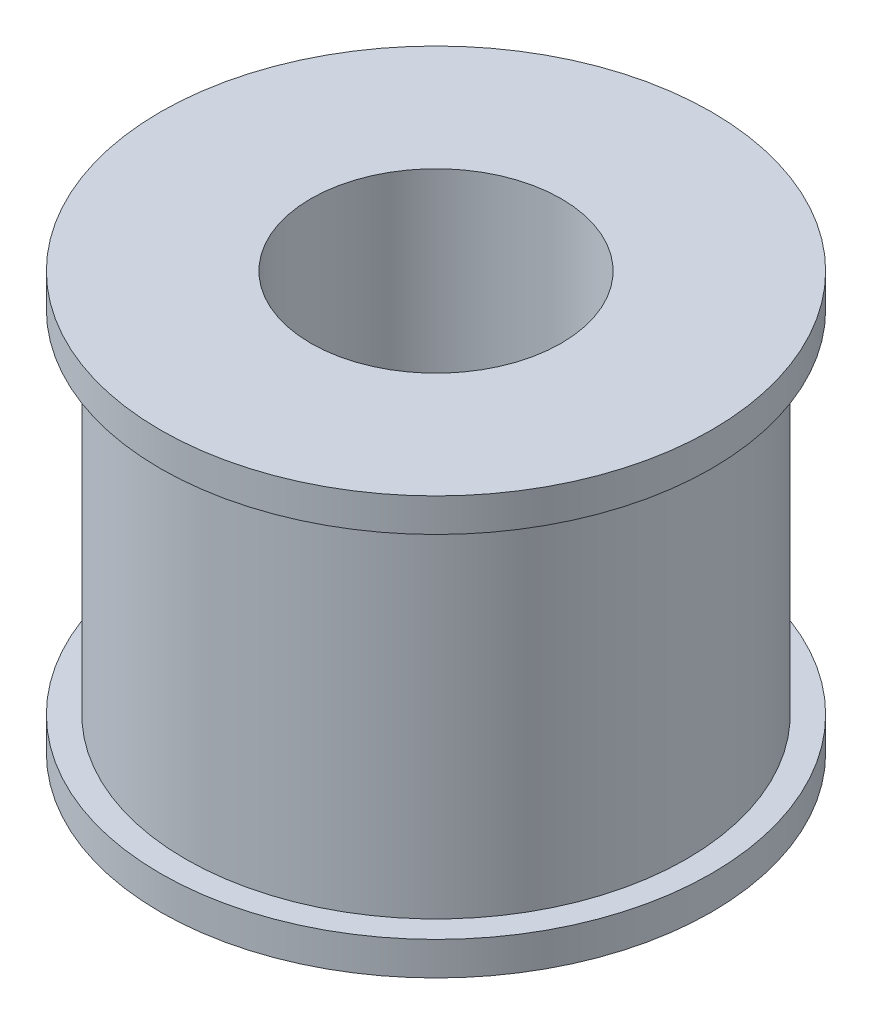
ISO-10303-21;
HEADER;
FILE_DESCRIPTION(('STEP AP214'),'2;1');
FILE_NAME('part.step','',(''),(''),'','','');
FILE_SCHEMA(('AUTOMOTIVE_DESIGN { 1 0 10303 214 1 1 1 1 }'));
ENDSEC;
DATA;
#1=APPLICATION_CONTEXT('core data for automotive mechanical design processes');
#2=APPLICATION_PROTOCOL_DEFINITION('international standard','automotive_design',2000,#1);
#3=PRODUCT_CONTEXT('',#1,'mechanical');
#4=PRODUCT('Part','Part','',(#3));
#5=PRODUCT_RELATED_PRODUCT_CATEGORY('part','',(#4));
#6=PRODUCT_DEFINITION_FORMATION('','',#4);
#7=PRODUCT_DEFINITION_CONTEXT('part definition',#1,'design');
#8=PRODUCT_DEFINITION('design','',#6,#7);
#9=PRODUCT_DEFINITION_SHAPE('','',#8);
#10=(LENGTH_UNIT() NAMED_UNIT(*) SI_UNIT(.MILLI.,.METRE.));
#11=(NAMED_UNIT(*) PLANE_ANGLE_UNIT() SI_UNIT($,.RADIAN.));
#12=(NAMED_UNIT(*) SI_UNIT($,.STERADIAN.) SOLID_ANGLE_UNIT());
#13=UNCERTAINTY_MEASURE_WITH_UNIT(LENGTH_MEASURE(1.E-05),#10,'distance_accuracy_value','');
#14=(GEOMETRIC_REPRESENTATION_CONTEXT(3) GLOBAL_UNCERTAINTY_ASSIGNED_CONTEXT((#13)) GLOBAL_UNIT_ASSIGNED_CONTEXT((#10,
#11,#12)) REPRESENTATION_CONTEXT('',''));
#15=CARTESIAN_POINT('',(0.,0.,0.));
#16=DIRECTION('',(0.,0.,1.));
#17=DIRECTION('',(1.,0.,0.));
#18=AXIS2_PLACEMENT_3D('',#15,#16,#17);
#19=CARTESIAN_POINT('',(0.,25.,0.));
#20=DIRECTION('',(0.,-1.,0.));
#21=DIRECTION('',(0.,0.,-1.));
#22=AXIS2_PLACEMENT_3D('',#19,#20,#21);
#23=CYLINDRICAL_SURFACE('',#22,3.);
#24=CARTESIAN_POINT('',(0.,0.,0.));
#25=DIRECTION('',(0.,1.,0.));
#26=DIRECTION('',(0.,0.,1.));
#27=AXIS2_PLACEMENT_3D('',#24,#25,#26);
#28=CIRCLE('',#27,3.);
#29=CARTESIAN_POINT('',(0.,0.,3.));
#30=VERTEX_POINT('',#29);
#31=EDGE_CURVE('E45',#30,#30,#28,.T.);
#32=ORIENTED_EDGE('',*,*,#31,.F.);
#33=EDGE_LOOP('',(#32));
#34=FACE_BOUND('',#33,.T.);
#35=CARTESIAN_POINT('',(1.625,5.,-2.521780125229));
#36=CARTESIAN_POINT('',(1.62499362610396,4.91647567107102,-2.52178884654117));
#37=CARTESIAN_POINT('',(1.61851585641467,4.83287244644267,-2.52599501945757));
#38=CARTESIAN_POINT('',(1.59297861462206,4.6683256364093,-2.54217064533891));
#39=CARTESIAN_POINT('',(1.57389710574364,4.58738697049031,-2.55415369499862));
#40=CARTESIAN_POINT('',(1.52427817740289,4.43087471587903,-2.58406681920894));
#41=CARTESIAN_POINT('',(1.49381028464491,4.35527181130049,-2.60196072584982));
#42=CARTESIAN_POINT('',(1.42249724665063,4.21027693964684,-2.64162110161326));
#43=CARTESIAN_POINT('',(1.38165016988108,4.14088613187722,-2.66338829131529));
#44=CARTESIAN_POINT('',(1.28606573612756,4.00281297757973,-2.71093173114226));
#45=CARTESIAN_POINT('',(1.23036059831293,3.93486364791188,-2.7368918673873));
#46=CARTESIAN_POINT('',(1.10864243894811,3.8086867522882,-2.78841941781855));
#47=CARTESIAN_POINT('',(1.04262348172815,3.75046482469484,-2.81398659649028));
#48=CARTESIAN_POINT('',(0.89551160217396,3.64066872614016,-2.86436429896294));
#49=CARTESIAN_POINT('',(0.813624236880456,3.59003997769905,-2.88893816491266));
#50=CARTESIAN_POINT('',(0.640911470519763,3.5036176638638,-2.9320863076302));
#51=CARTESIAN_POINT('',(0.550092737901573,3.46781313274385,-2.95066501686498));
#52=CARTESIAN_POINT('',(0.369897501143644,3.41510793344741,-2.97838863309815));
#53=CARTESIAN_POINT('',(0.281002067442789,3.39690896510625,-2.98817676403926));
#54=CARTESIAN_POINT('',(0.100927404427291,3.37561060880875,-2.99965505637116));
#55=CARTESIAN_POINT('',(0.00974989246369477,3.37250019032237,-3.00135113346747));
#56=CARTESIAN_POINT('',(-0.162347576331279,3.38107155998096,-2.99671477897577));
#57=CARTESIAN_POINT('',(-0.243368142517105,3.39128192920775,-2.99118088232813));
#58=CARTESIAN_POINT('',(-0.402336701214962,3.42350767664372,-2.97397337010464));
#59=CARTESIAN_POINT('',(-0.480284458564604,3.44552395648496,-2.96229928559631));
#60=CARTESIAN_POINT('',(-0.63207455464856,3.50076381349264,-2.93368734546312));
#61=CARTESIAN_POINT('',(-0.705859929075177,3.53411235165183,-2.91669097245024));
#62=CARTESIAN_POINT('',(-0.846938184886932,3.61083633152674,-2.87889510857995));
#63=CARTESIAN_POINT('',(-0.91422892621452,3.65421506242804,-2.85809437063173));
#64=CARTESIAN_POINT('',(-1.04801466719267,3.75499915650264,-2.8119717864549));
#65=CARTESIAN_POINT('',(-1.11367327603698,3.81340264002554,-2.78640445121692));
#66=CARTESIAN_POINT('',(-1.23475234459078,3.93995606194131,-2.73490853839924));
#67=CARTESIAN_POINT('',(-1.2901626002163,4.00811559576566,-2.7089796281294));
#68=CARTESIAN_POINT('',(-1.39377486129465,4.15911791911366,-2.65725751747602));
#69=CARTESIAN_POINT('',(-1.44098913960444,4.24271143567745,-2.63165629719171));
#70=CARTESIAN_POINT('',(-1.5203587042321,4.41828931014661,-2.58662109254775));
#71=CARTESIAN_POINT('',(-1.55253127212028,4.51026389300709,-2.56718003903186));
#72=CARTESIAN_POINT('',(-1.59812522493745,4.69228534022437,-2.53902859798761));
#73=CARTESIAN_POINT('',(-1.61285549939508,4.78188382300329,-2.52957594769987));
#74=CARTESIAN_POINT('',(-1.62709553982775,4.96273938431094,-2.52044556051586));
#75=CARTESIAN_POINT('',(-1.6266213251134,5.05399461596327,-2.52075753569134));
#76=CARTESIAN_POINT('',(-1.6116650884512,5.22196402891728,-2.53033241096107));
#77=CARTESIAN_POINT('',(-1.59913775035001,5.2989374702016,-2.53834610426687));
#78=CARTESIAN_POINT('',(-1.56351314461445,5.44948708742494,-2.56044192007669));
#79=CARTESIAN_POINT('',(-1.54041149876914,5.52306184225863,-2.57452655606692));
#80=CARTESIAN_POINT('',(-1.48330763694687,5.66842211919627,-2.60785937209035));
#81=CARTESIAN_POINT('',(-1.44887654692676,5.73999204648474,-2.62730481169378));
#82=CARTESIAN_POINT('',(-1.37044806619068,5.87676666541915,-2.66905325078274));
#83=CARTESIAN_POINT('',(-1.32644586554113,5.94196813265417,-2.69135768472439));
#84=CARTESIAN_POINT('',(-1.22230316396257,6.07459354253663,-2.74039556583206));
#85=CARTESIAN_POINT('',(-1.16072421643766,6.14083561603439,-2.76728512045753));
#86=CARTESIAN_POINT('',(-1.02707583252912,6.26250184432116,-2.81962198065225));
#87=CARTESIAN_POINT('',(-0.955000762805303,6.31792015229087,-2.84506850148092));
#88=CARTESIAN_POINT('',(-0.798115671580059,6.41870176479678,-2.89310153929838));
#89=CARTESIAN_POINT('',(-0.712872708944511,6.46348615652539,-2.91550295414492));
#90=CARTESIAN_POINT('',(-0.534505621432121,6.53760486976178,-2.9534021705525));
#91=CARTESIAN_POINT('',(-0.44138960806974,6.56695487331969,-2.96890697690612));
#92=CARTESIAN_POINT('',(-0.259992391421341,6.60647524542024,-2.98996496264615));
#93=CARTESIAN_POINT('',(-0.172164501552213,6.61827549628704,-2.99636104576615));
#94=CARTESIAN_POINT('',(0.00444487101537017,6.62739394717314,-3.00129434113477));
#95=CARTESIAN_POINT('',(0.093225862830992,6.62471927583816,-2.99983542183636));
#96=CARTESIAN_POINT('',(0.261188522805945,6.60590681183214,-2.98969237921464));
#97=CARTESIAN_POINT('',(0.340543637188175,6.59093537023404,-2.98163436789865));
#98=CARTESIAN_POINT('',(0.495432823547957,6.54970841054607,-2.95984216222459));
#99=CARTESIAN_POINT('',(0.570966424731545,6.52345150590093,-2.94610727040123));
#100=CARTESIAN_POINT('',(0.719186038389683,6.45950257807398,-2.91354409902028));
#101=CARTESIAN_POINT('',(0.791671383281743,6.42143261692066,-2.89455012777675));
#102=CARTESIAN_POINT('',(0.929476456393731,6.3354043604806,-2.8532886071291));
#103=CARTESIAN_POINT('',(0.99479316752873,6.287441925984,-2.83101968854409));
#104=CARTESIAN_POINT('',(1.12421459926918,6.17677982546555,-2.78234471532874));
#105=CARTESIAN_POINT('',(1.18735256260398,6.11302832046199,-2.75575528045836));
#106=CARTESIAN_POINT('',(1.30249662530647,5.97578738089303,-2.7032419755199));
#107=CARTESIAN_POINT('',(1.35448979132518,5.9022867910228,-2.67731890912275));
#108=CARTESIAN_POINT('',(1.44880285545911,5.74212188572276,-2.62754301941557));
#109=CARTESIAN_POINT('',(1.49035401575236,5.65493203097275,-2.60390811353569));
#110=CARTESIAN_POINT('',(1.55758520350058,5.47314904038028,-2.56427012470215));
#111=CARTESIAN_POINT('',(1.58331656006501,5.37858098159521,-2.54824239842196));
#112=CARTESIAN_POINT('',(1.60851613266538,5.2356472359366,-2.53234221331271));
#113=CARTESIAN_POINT('',(1.61468341643518,5.18882820241346,-2.52840291933054));
#114=CARTESIAN_POINT('',(1.62292718367799,5.0946812366103,-2.52311938607778));
#115=CARTESIAN_POINT('',(1.62500361361774,5.04735329767885,-2.52177518076675));
#116=CARTESIAN_POINT('',(1.625,5.,-2.521780125229));
#117=B_SPLINE_CURVE_WITH_KNOTS('',3,(#35,#36,#37,#38,#39,#40,#41,#42,#43,#44,#45,#46,#47,#48,
#49,#50,#51,#52,#53,#54,#55,#56,#57,#58,#59,#60,#61,#62,#63,#64,#65,#66,#67,#68,#69,#70,#71,#72,
#73,#74,#75,#76,#77,#78,#79,#80,#81,#82,#83,#84,#85,#86,#87,#88,#89,#90,#91,#92,#93,#94,#95,#96,
#97,#98,#99,#100,#101,#102,#103,#104,#105,#106,#107,#108,#109,#110,#111,#112,#113,#114,#115,
#116),.UNSPECIFIED.,.T.,.F.,(4,2,2,2,2,2,2,2,2,2,2,2,2,2,2,2,2,2,2,2,2,2,2,2,2,2,2,2,2,2,2,2,2,
2,2,2,2,2,2,2,4),(0.,0.250372371078242,0.501183664001882,0.750487850304348,0.999838465347706,
1.27357587393855,1.54747140449562,1.84397527167813,2.14025941634808,2.41249928639615,
2.68454010463896,2.92892931461192,3.17333719155109,3.42053266619159,3.66780931851591,
3.94123094413897,4.21492336171583,4.51146085049713,4.80765680207996,5.079836201185,
5.35172884399928,5.58585847738579,5.82008513815954,6.06445887718592,6.30895571043233,
6.59079991795693,6.87279595452077,7.16774738273199,7.46239854482431,7.72746451911719,
7.99239996494183,8.23476524078876,8.47716030264913,8.72828927356825,8.97952353584611,
9.25908071892252,9.53896058773721,9.83565375839589,10.1313791234398,10.2733234218883,
10.4152695778198),.UNSPECIFIED.);
#118=CARTESIAN_POINT('',(1.625,5.,-2.521780125229));
#119=VERTEX_POINT('',#118);
#120=EDGE_CURVE('E69',#119,#119,#117,.T.);
#121=ORIENTED_EDGE('',*,*,#120,.T.);
#122=EDGE_LOOP('',(#121));
#123=FACE_BOUND('',#122,.T.);
#124=CARTESIAN_POINT('',(0.,9.,0.));
#125=DIRECTION('',(0.,1.,0.));
#126=DIRECTION('',(0.,0.,1.));
#127=AXIS2_PLACEMENT_3D('',#124,#125,#126);
#128=CIRCLE('',#127,3.);
#129=CARTESIAN_POINT('',(0.,9.,3.));
#130=VERTEX_POINT('',#129);
#131=EDGE_CURVE('E36',#130,#130,#128,.T.);
#132=ORIENTED_EDGE('',*,*,#131,.T.);
#133=EDGE_LOOP('',(#132));
#134=FACE_BOUND('',#133,.T.);
#135=ADVANCED_FACE('F32',(#34,#123,#134),#23,.F.);
#136=CARTESIAN_POINT('',(0.,25.,0.));
#137=DIRECTION('',(0.,-1.,0.));
#138=DIRECTION('',(0.,0.,-1.));
#139=AXIS2_PLACEMENT_3D('',#136,#137,#138);
#140=CYLINDRICAL_SURFACE('',#139,15.);
#141=CARTESIAN_POINT('',(1.625,5.,-14.9117193844305));
#142=CARTESIAN_POINT('',(1.62499607951809,4.9090108416416,-14.9117205336342));
#143=CARTESIAN_POINT('',(1.61733206770543,4.81796253610688,-14.9125611691408));
#144=CARTESIAN_POINT('',(1.58687625220947,4.63839321362523,-14.915832168487));
#145=CARTESIAN_POINT('',(1.56406804372355,4.54987504600155,-14.9182642562102));
#146=CARTESIAN_POINT('',(1.50399836576417,4.37799225972297,-14.9244395173036));
#147=CARTESIAN_POINT('',(1.46674598159897,4.29462443966606,-14.9281818663832));
#148=CARTESIAN_POINT('',(1.37886351672704,4.13534161716927,-14.9365549747082));
#149=CARTESIAN_POINT('',(1.32823597825778,4.05942520218556,-14.9411855650784));
#150=CARTESIAN_POINT('',(1.21480991566068,3.91686096045494,-14.9508354029994));
#151=CARTESIAN_POINT('',(1.15196613450361,3.85024923206282,-14.9558560527334));
#152=CARTESIAN_POINT('',(1.01598848819612,3.7284963918019,-14.9657076223121));
#153=CARTESIAN_POINT('',(0.942854140085716,3.67335581860202,-14.9705385332384));
#154=CARTESIAN_POINT('',(0.788148146230986,3.5759840546106,-14.979480349489));
#155=CARTESIAN_POINT('',(0.706556115495929,3.53378507179415,-14.9835894477508));
#156=CARTESIAN_POINT('',(0.537392028738915,3.46370047953315,-14.9906093408174));
#157=CARTESIAN_POINT('',(0.449820142002624,3.43581446508836,-14.993520169528));
#158=CARTESIAN_POINT('',(0.271548635235109,3.39525397713153,-14.9978056971795));
#159=CARTESIAN_POINT('',(0.180862714678987,3.38251993717447,-14.9991864099331));
#160=CARTESIAN_POINT('',(-0.00136887809288493,3.37244046943757,-15.0002766179743));
#161=CARTESIAN_POINT('',(-0.0929145243656087,3.37509457878616,-14.99998616353));
#162=CARTESIAN_POINT('',(-0.273862279448701,3.39566790771732,-14.9977716675837));
#163=CARTESIAN_POINT('',(-0.36327176672863,3.41352307287695,-14.9958544809421));
#164=CARTESIAN_POINT('',(-0.537817561741082,3.46389177662204,-14.9906097658352));
#165=CARTESIAN_POINT('',(-0.622953805784831,3.49640553360832,-14.9872822163566));
#166=CARTESIAN_POINT('',(-0.786737204499769,3.57523805176723,-14.979579002581));
#167=CARTESIAN_POINT('',(-0.865370704832735,3.62158496440318,-14.9752012045523));
#168=CARTESIAN_POINT('',(-1.0137675205992,3.72674772430712,-14.9658882801973));
#169=CARTESIAN_POINT('',(-1.08353053033313,3.78556400111476,-14.9609531346744));
#170=CARTESIAN_POINT('',(-1.21258158390715,3.9143557017455,-14.9510489609166));
#171=CARTESIAN_POINT('',(-1.27181399609965,3.9843868798984,-14.9460798888296));
#172=CARTESIAN_POINT('',(-1.37769125065725,4.13342770218761,-14.9366931075787));
#173=CARTESIAN_POINT('',(-1.42433606915497,4.21243736334765,-14.9322753994602));
#174=CARTESIAN_POINT('',(-1.50371485192156,4.37723721180423,-14.9244913010396));
#175=CARTESIAN_POINT('',(-1.53644506541173,4.46302921994805,-14.9211251942686));
#176=CARTESIAN_POINT('',(-1.58701989180505,4.6389358914823,-14.9158311966687));
#177=CARTESIAN_POINT('',(-1.60486503894023,4.72905039961339,-14.9139032542237));
#178=CARTESIAN_POINT('',(-1.62509096228955,4.91055475629357,-14.9117129877457));
#179=CARTESIAN_POINT('',(-1.6275497095449,5.00193581884558,-14.9114422658505));
#180=CARTESIAN_POINT('',(-1.61713810395813,5.18380861017386,-14.9125749184418));
#181=CARTESIAN_POINT('',(-1.60426799494733,5.27430035307318,-14.9139782662994));
#182=CARTESIAN_POINT('',(-1.56362937642419,5.45159653584044,-14.9182932910546));
#183=CARTESIAN_POINT('',(-1.53589800835291,5.53840958838293,-14.9212012070943));
#184=CARTESIAN_POINT('',(-1.46636207739473,5.70615233356266,-14.9281946726837));
#185=CARTESIAN_POINT('',(-1.42455713824991,5.78708186883329,-14.9322802537179));
#186=CARTESIAN_POINT('',(-1.32786654917253,5.94111487230612,-14.941188975875));
#187=CARTESIAN_POINT('',(-1.27292939659526,6.01418584194673,-14.9460149935006));
#188=CARTESIAN_POINT('',(-1.15160734855488,6.15009731222767,-14.9558515297871));
#189=CARTESIAN_POINT('',(-1.08522212005016,6.2129375151363,-14.9608620538123));
#190=CARTESIAN_POINT('',(-0.942549364034599,6.32687408297659,-14.970528538951));
#191=CARTESIAN_POINT('',(-0.866221001315747,6.37791946791369,-14.9751829048162));
#192=CARTESIAN_POINT('',(-0.706029387134965,6.46646600456177,-14.9835892449075));
#193=CARTESIAN_POINT('',(-0.622166254347312,6.50396736954735,-14.9873412333428));
#194=CARTESIAN_POINT('',(-0.449460968850121,6.56427563446597,-14.9935129098066));
#195=CARTESIAN_POINT('',(-0.360629526752095,6.58711291323968,-14.995935350668));
#196=CARTESIAN_POINT('',(-0.180365296449006,6.6175437924483,-14.999186329398));
#197=CARTESIAN_POINT('',(-0.0889325950610979,6.62513790102089,-15.0000149203982));
#198=CARTESIAN_POINT('',(0.09343890925348,6.62485900793099,-14.9999847446418));
#199=CARTESIAN_POINT('',(0.18437784462988,6.61706497990256,-14.9991345933745));
#200=CARTESIAN_POINT('',(0.363646086561017,6.58639717389963,-14.9958594851579));
#201=CARTESIAN_POINT('',(0.451975392109846,6.56352339011256,-14.9934345276017));
#202=CARTESIAN_POINT('',(0.623513348873704,6.50336819065134,-14.9872813405323));
#203=CARTESIAN_POINT('',(0.706722983882575,6.46608955309469,-14.9835533623327));
#204=CARTESIAN_POINT('',(0.865716968282426,6.37819112870105,-14.9752088384087));
#205=CARTESIAN_POINT('',(0.941501319840049,6.32757134575692,-14.9705922929434));
#206=CARTESIAN_POINT('',(1.08389799384492,6.21413237859641,-14.960958916983));
#207=CARTESIAN_POINT('',(1.15046331474937,6.15125435063952,-14.9559402273796));
#208=CARTESIAN_POINT('',(1.27213126805333,6.01520254653594,-14.9460837090211));
#209=CARTESIAN_POINT('',(1.3272311582968,5.94202631439452,-14.9412459237589));
#210=CARTESIAN_POINT('',(1.42453604787585,5.78721552316423,-14.9322837858294));
#211=CARTESIAN_POINT('',(1.46670268012169,5.7055567413385,-14.9281615713388));
#212=CARTESIAN_POINT('',(1.53666786469777,5.53632304387261,-14.9211225978569));
#213=CARTESIAN_POINT('',(1.56448244506817,5.44875485190011,-14.9182044948746));
#214=CARTESIAN_POINT('',(1.59810281600453,5.30058619999483,-14.9146316623786));
#215=CARTESIAN_POINT('',(1.60817525625295,5.24092938535957,-14.913544806398));
#216=CARTESIAN_POINT('',(1.62162513312488,5.12085707759251,-14.9120882875807));
#217=CARTESIAN_POINT('',(1.62500260426801,5.06044158837411,-14.9117186210462));
#218=CARTESIAN_POINT('',(1.625,5.,-14.9117193844305));
#219=B_SPLINE_CURVE_WITH_KNOTS('',3,(#141,#142,#143,#144,#145,#146,#147,#148,#149,#150,#151,
#152,#153,#154,#155,#156,#157,#158,#159,#160,#161,#162,#163,#164,#165,#166,#167,#168,#169,#170,
#171,#172,#173,#174,#175,#176,#177,#178,#179,#180,#181,#182,#183,#184,#185,#186,#187,#188,#189,
#190,#191,#192,#193,#194,#195,#196,#197,#198,#199,#200,#201,#202,#203,#204,#205,#206,#207,#208,
#209,#210,#211,#212,#213,#214,#215,#216,#217,#218),.UNSPECIFIED.,.T.,.F.,(4,2,2,2,2,2,2,2,2,2,2,
2,2,2,2,2,2,2,2,2,2,2,2,2,2,2,2,2,2,2,2,2,2,2,2,2,2,2,4),(0.,0.272746729141454,
0.545789391564964,0.818660589509165,1.09147995964616,1.36532998736278,1.63919287178087,
1.91373189405753,2.18826314754028,2.46171154174663,2.73515171073829,3.00744532447488,
3.2797429952938,3.55259863422501,3.82546367390541,4.09972995287852,4.37399675188556,
4.64833743461444,4.92266827070322,5.1956077937417,5.46854297527464,5.74079919344049,
6.01306269097386,6.28641201040306,6.55976928331395,6.83428684697462,7.10880008768134,
7.38274278269506,7.65667634555892,7.92920770492192,8.20173916933351,8.4742180995881,
8.74669695033509,9.02051751499351,9.29440349349468,9.5690942792563,9.84347762910006,
10.0246566929585,10.2058348226453),.UNSPECIFIED.);
#220=CARTESIAN_POINT('',(1.625,5.,-14.9117193844305));
#221=VERTEX_POINT('',#220);
#222=EDGE_CURVE('E74',#221,#221,#219,.T.);
#223=ORIENTED_EDGE('',*,*,#222,.F.);
#224=EDGE_LOOP('',(#223));
#225=FACE_BOUND('',#224,.T.);
#226=CARTESIAN_POINT('',(0.,2.,0.));
#227=DIRECTION('',(0.,-1.,0.));
#228=DIRECTION('',(0.,0.,-1.));
#229=AXIS2_PLACEMENT_3D('',#226,#227,#228);
#230=CIRCLE('',#229,15.);
#231=CARTESIAN_POINT('',(0.,2.,-15.));
#232=VERTEX_POINT('',#231);
#233=EDGE_CURVE('E40',#232,#232,#230,.T.);
#234=ORIENTED_EDGE('',*,*,#233,.F.);
#235=EDGE_LOOP('',(#234));
#236=FACE_BOUND('',#235,.T.);
#237=CARTESIAN_POINT('',(0.,23.,0.));
#238=DIRECTION('',(0.,1.,0.));
#239=DIRECTION('',(0.,0.,1.));
#240=AXIS2_PLACEMENT_3D('',#237,#238,#239);
#241=CIRCLE('',#240,15.);
#242=CARTESIAN_POINT('',(0.,23.,15.));
#243=VERTEX_POINT('',#242);
#244=EDGE_CURVE('E10',#243,#243,#241,.T.);
#245=ORIENTED_EDGE('',*,*,#244,.F.);
#246=EDGE_LOOP('',(#245));
#247=FACE_BOUND('',#246,.T.);
#248=ADVANCED_FACE('F34',(#225,#236,#247),#140,.T.);
#249=CARTESIAN_POINT('',(0.,25.,0.));
#250=DIRECTION('',(0.,1.,0.));
#251=DIRECTION('',(0.,0.,1.));
#252=AXIS2_PLACEMENT_3D('',#249,#250,#251);
#253=PLANE('',#252);
#254=CARTESIAN_POINT('',(0.,25.,0.));
#255=DIRECTION('',(0.,1.,0.));
#256=DIRECTION('',(0.,0.,1.));
#257=AXIS2_PLACEMENT_3D('',#254,#255,#256);
#258=CIRCLE('',#257,7.5);
#259=CARTESIAN_POINT('',(0.,25.,7.5));
#260=VERTEX_POINT('',#259);
#261=EDGE_CURVE('E77',#260,#260,#258,.T.);
#262=ORIENTED_EDGE('',*,*,#261,.F.);
#263=EDGE_LOOP('',(#262));
#264=FACE_BOUND('',#263,.T.);
#265=CARTESIAN_POINT('',(0.,25.,0.));
#266=DIRECTION('',(0.,1.,0.));
#267=DIRECTION('',(0.,0.,1.));
#268=AXIS2_PLACEMENT_3D('',#265,#266,#267);
#269=CIRCLE('',#268,16.5);
#270=CARTESIAN_POINT('',(0.,25.,16.5));
#271=VERTEX_POINT('',#270);
#272=EDGE_CURVE('E49',#271,#271,#269,.T.);
#273=ORIENTED_EDGE('',*,*,#272,.T.);
#274=EDGE_LOOP('',(#273));
#275=FACE_BOUND('',#274,.T.);
#276=ADVANCED_FACE('F157',(#264,#275),#253,.T.);
#277=CARTESIAN_POINT('',(0.,0.,0.));
#278=DIRECTION('',(0.,1.,0.));
#279=DIRECTION('',(0.,0.,1.));
#280=AXIS2_PLACEMENT_3D('',#277,#278,#279);
#281=PLANE('',#280);
#282=ORIENTED_EDGE('',*,*,#31,.T.);
#283=EDGE_LOOP('',(#282));
#284=FACE_BOUND('',#283,.T.);
#285=CARTESIAN_POINT('',(0.,0.,0.));
#286=DIRECTION('',(0.,-1.,0.));
#287=DIRECTION('',(0.,0.,-1.));
#288=AXIS2_PLACEMENT_3D('',#285,#286,#287);
#289=CIRCLE('',#288,16.5);
#290=CARTESIAN_POINT('',(0.,0.,-16.5));
#291=VERTEX_POINT('',#290);
#292=EDGE_CURVE('E54',#291,#291,#289,.T.);
#293=ORIENTED_EDGE('',*,*,#292,.T.);
#294=EDGE_LOOP('',(#293));
#295=FACE_BOUND('',#294,.T.);
#296=ADVANCED_FACE('F60',(#284,#295),#281,.F.);
#297=CARTESIAN_POINT('',(0.,2.,0.));
#298=DIRECTION('',(0.,-1.,0.));
#299=DIRECTION('',(0.,0.,-1.));
#300=AXIS2_PLACEMENT_3D('',#297,#298,#299);
#301=PLANE('',#300);
#302=CARTESIAN_POINT('',(0.,2.,0.));
#303=DIRECTION('',(0.,-1.,0.));
#304=DIRECTION('',(0.,0.,-1.));
#305=AXIS2_PLACEMENT_3D('',#302,#303,#304);
#306=CIRCLE('',#305,16.5);
#307=CARTESIAN_POINT('',(0.,2.,-16.5));
#308=VERTEX_POINT('',#307);
#309=EDGE_CURVE('E51',#308,#308,#306,.T.);
#310=ORIENTED_EDGE('',*,*,#309,.F.);
#311=EDGE_LOOP('',(#310));
#312=FACE_BOUND('',#311,.T.);
#313=ORIENTED_EDGE('',*,*,#233,.T.);
#314=EDGE_LOOP('',(#313));
#315=FACE_BOUND('',#314,.T.);
#316=ADVANCED_FACE('F142',(#312,#315),#301,.F.);
#317=CARTESIAN_POINT('',(0.,2.,0.));
#318=DIRECTION('',(0.,-1.,0.));
#319=DIRECTION('',(0.,0.,-1.));
#320=AXIS2_PLACEMENT_3D('',#317,#318,#319);
#321=CYLINDRICAL_SURFACE('',#320,16.5);
#322=ORIENTED_EDGE('',*,*,#309,.T.);
#323=EDGE_LOOP('',(#322));
#324=FACE_BOUND('',#323,.T.);
#325=ORIENTED_EDGE('',*,*,#292,.F.);
#326=EDGE_LOOP('',(#325));
#327=FACE_BOUND('',#326,.T.);
#328=ADVANCED_FACE('F135',(#324,#327),#321,.T.);
#329=CARTESIAN_POINT('',(0.,23.,0.));
#330=DIRECTION('',(0.,1.,0.));
#331=DIRECTION('',(0.,0.,1.));
#332=AXIS2_PLACEMENT_3D('',#329,#330,#331);
#333=PLANE('',#332);
#334=CARTESIAN_POINT('',(0.,23.,0.));
#335=DIRECTION('',(0.,1.,0.));
#336=DIRECTION('',(0.,0.,1.));
#337=AXIS2_PLACEMENT_3D('',#334,#335,#336);
#338=CIRCLE('',#337,16.5);
#339=CARTESIAN_POINT('',(0.,23.,16.5));
#340=VERTEX_POINT('',#339);
#341=EDGE_CURVE('E56',#340,#340,#338,.T.);
#342=ORIENTED_EDGE('',*,*,#341,.F.);
#343=EDGE_LOOP('',(#342));
#344=FACE_BOUND('',#343,.T.);
#345=ORIENTED_EDGE('',*,*,#244,.T.);
#346=EDGE_LOOP('',(#345));
#347=FACE_BOUND('',#346,.T.);
#348=ADVANCED_FACE('F127',(#344,#347),#333,.F.);
#349=CARTESIAN_POINT('',(0.,23.,0.));
#350=DIRECTION('',(0.,1.,0.));
#351=DIRECTION('',(0.,0.,1.));
#352=AXIS2_PLACEMENT_3D('',#349,#350,#351);
#353=CYLINDRICAL_SURFACE('',#352,16.5);
#354=ORIENTED_EDGE('',*,*,#341,.T.);
#355=EDGE_LOOP('',(#354));
#356=FACE_BOUND('',#355,.T.);
#357=ORIENTED_EDGE('',*,*,#272,.F.);
#358=EDGE_LOOP('',(#357));
#359=FACE_BOUND('',#358,.T.);
#360=ADVANCED_FACE('F118',(#356,#359),#353,.T.);
#361=CARTESIAN_POINT('',(0.,5.,-16.501));
#362=DIRECTION('',(0.,0.,1.));
#363=DIRECTION('',(1.,0.,0.));
#364=AXIS2_PLACEMENT_3D('',#361,#362,#363);
#365=CYLINDRICAL_SURFACE('',#364,1.625);
#366=ORIENTED_EDGE('',*,*,#120,.F.);
#367=EDGE_LOOP('',(#366));
#368=FACE_BOUND('',#367,.T.);
#369=ORIENTED_EDGE('',*,*,#222,.T.);
#370=EDGE_LOOP('',(#369));
#371=FACE_BOUND('',#370,.T.);
#372=ADVANCED_FACE('F93',(#368,#371),#365,.F.);
#373=CARTESIAN_POINT('',(0.,9.,0.));
#374=DIRECTION('',(0.,1.,0.));
#375=DIRECTION('',(0.,0.,1.));
#376=AXIS2_PLACEMENT_3D('',#373,#374,#375);
#377=CYLINDRICAL_SURFACE('',#376,7.5);
#378=CARTESIAN_POINT('',(0.,9.,0.));
#379=DIRECTION('',(0.,1.,0.));
#380=DIRECTION('',(0.,0.,1.));
#381=AXIS2_PLACEMENT_3D('',#378,#379,#380);
#382=CIRCLE('',#381,7.5);
#383=CARTESIAN_POINT('',(0.,9.,7.5));
#384=VERTEX_POINT('',#383);
#385=EDGE_CURVE('E73',#384,#384,#382,.T.);
#386=ORIENTED_EDGE('',*,*,#385,.F.);
#387=EDGE_LOOP('',(#386));
#388=FACE_BOUND('',#387,.T.);
#389=ORIENTED_EDGE('',*,*,#261,.T.);
#390=EDGE_LOOP('',(#389));
#391=FACE_BOUND('',#390,.T.);
#392=ADVANCED_FACE('F98',(#388,#391),#377,.F.);
#393=CARTESIAN_POINT('',(0.,9.,0.));
#394=DIRECTION('',(0.,1.,0.));
#395=DIRECTION('',(0.,0.,1.));
#396=AXIS2_PLACEMENT_3D('',#393,#394,#395);
#397=PLANE('',#396);
#398=ORIENTED_EDGE('',*,*,#131,.F.);
#399=EDGE_LOOP('',(#398));
#400=FACE_BOUND('',#399,.T.);
#401=ORIENTED_EDGE('',*,*,#385,.T.);
#402=EDGE_LOOP('',(#401));
#403=FACE_BOUND('',#402,.T.);
#404=ADVANCED_FACE('F102',(#400,#403),#397,.T.);
#405=CLOSED_SHELL('',(#135,#248,#276,#296,#316,#328,#348,#360,#372,#392,#404));
#406=MANIFOLD_SOLID_BREP('B2',#405);
#407=ADVANCED_BREP_SHAPE_REPRESENTATION('',(#18,#406),#14);
#408=SHAPE_DEFINITION_REPRESENTATION(#9,#407);
ENDSEC;
END-ISO-10303-21;
